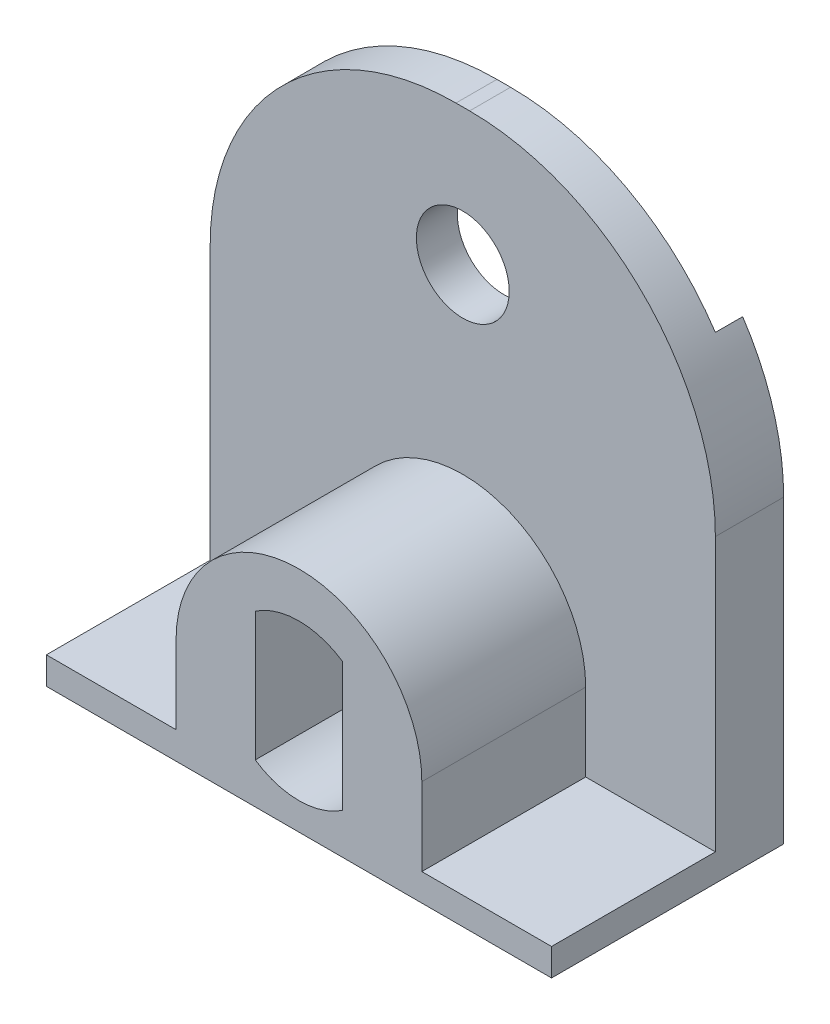
ISO-10303-21;
HEADER;
FILE_DESCRIPTION(('STEP AP214'),'2;1');
FILE_NAME('part.step','',(''),(''),'','','');
FILE_SCHEMA(('AUTOMOTIVE_DESIGN { 1 0 10303 214 1 1 1 1 }'));
ENDSEC;
DATA;
#1=APPLICATION_CONTEXT('core data for automotive mechanical design processes');
#2=APPLICATION_PROTOCOL_DEFINITION('international standard','automotive_design',2000,#1);
#3=PRODUCT_CONTEXT('',#1,'mechanical');
#4=PRODUCT('Part','Part','',(#3));
#5=PRODUCT_RELATED_PRODUCT_CATEGORY('part','',(#4));
#6=PRODUCT_DEFINITION_FORMATION('','',#4);
#7=PRODUCT_DEFINITION_CONTEXT('part definition',#1,'design');
#8=PRODUCT_DEFINITION('design','',#6,#7);
#9=PRODUCT_DEFINITION_SHAPE('','',#8);
#10=(LENGTH_UNIT() NAMED_UNIT(*) SI_UNIT(.MILLI.,.METRE.));
#11=(NAMED_UNIT(*) PLANE_ANGLE_UNIT() SI_UNIT($,.RADIAN.));
#12=(NAMED_UNIT(*) SI_UNIT($,.STERADIAN.) SOLID_ANGLE_UNIT());
#13=UNCERTAINTY_MEASURE_WITH_UNIT(LENGTH_MEASURE(1.E-05),#10,'distance_accuracy_value','');
#14=(GEOMETRIC_REPRESENTATION_CONTEXT(3) GLOBAL_UNCERTAINTY_ASSIGNED_CONTEXT((#13)) GLOBAL_UNIT_ASSIGNED_CONTEXT((#10,
#11,#12)) REPRESENTATION_CONTEXT('',''));
#15=CARTESIAN_POINT('',(0.,0.,0.));
#16=DIRECTION('',(0.,0.,1.));
#17=DIRECTION('',(1.,0.,0.));
#18=AXIS2_PLACEMENT_3D('',#15,#16,#17);
#19=CARTESIAN_POINT('',(-1.5,20.,1.5));
#20=DIRECTION('',(0.,0.,-1.));
#21=DIRECTION('',(-1.,0.,0.));
#22=AXIS2_PLACEMENT_3D('',#19,#20,#21);
#23=PLANE('',#22);
#24=CARTESIAN_POINT('',(7.75,15.,1.5));
#25=DIRECTION('',(0.,0.,1.));
#26=DIRECTION('',(1.,0.,0.));
#27=AXIS2_PLACEMENT_3D('',#24,#25,#26);
#28=CIRCLE('',#27,1.7);
#29=CARTESIAN_POINT('',(9.45,15.,1.5));
#30=VERTEX_POINT('',#29);
#31=EDGE_CURVE('E246',#30,#30,#28,.T.);
#32=ORIENTED_EDGE('',*,*,#31,.F.);
#33=EDGE_LOOP('',(#32));
#34=FACE_BOUND('',#33,.T.);
#35=DIRECTION('',(0.,-1.,0.));
#36=VECTOR('',#35,1.);
#37=CARTESIAN_POINT('',(3.25,1.02379637549047,1.5));
#38=LINE('',#37,#36);
#39=CARTESIAN_POINT('',(3.25,3.85,1.5));
#40=VERTEX_POINT('',#39);
#41=CARTESIAN_POINT('',(3.25,1.,1.5));
#42=VERTEX_POINT('',#41);
#43=EDGE_CURVE('E188',#40,#42,#38,.T.);
#44=ORIENTED_EDGE('',*,*,#43,.F.);
#45=CARTESIAN_POINT('',(7.75,3.85,1.5));
#46=DIRECTION('',(0.,0.,1.));
#47=DIRECTION('',(1.,0.,0.));
#48=AXIS2_PLACEMENT_3D('',#45,#46,#47);
#49=CIRCLE('',#48,4.5);
#50=CARTESIAN_POINT('',(12.25,3.85,1.5));
#51=VERTEX_POINT('',#50);
#52=EDGE_CURVE('E200',#51,#40,#49,.T.);
#53=ORIENTED_EDGE('',*,*,#52,.F.);
#54=DIRECTION('',(0.,1.,0.));
#55=VECTOR('',#54,1.);
#56=CARTESIAN_POINT('',(12.25,1.02379637549047,1.5));
#57=LINE('',#56,#55);
#58=CARTESIAN_POINT('',(12.25,1.,1.5));
#59=VERTEX_POINT('',#58);
#60=EDGE_CURVE('E187',#59,#51,#57,.T.);
#61=ORIENTED_EDGE('',*,*,#60,.F.);
#62=DIRECTION('',(-1.,0.,0.));
#63=VECTOR('',#62,1.);
#64=CARTESIAN_POINT('',(-1.5,1.,1.5));
#65=LINE('',#64,#63);
#66=CARTESIAN_POINT('',(17.,1.,1.5));
#67=VERTEX_POINT('',#66);
#68=EDGE_CURVE('E59',#67,#59,#65,.T.);
#69=ORIENTED_EDGE('',*,*,#68,.F.);
#70=DIRECTION('',(0.,-1.,0.));
#71=VECTOR('',#70,1.);
#72=CARTESIAN_POINT('',(17.,20.,1.5));
#73=LINE('',#72,#71);
#74=CARTESIAN_POINT('',(17.,11.,1.5));
#75=VERTEX_POINT('',#74);
#76=EDGE_CURVE('E283',#75,#67,#73,.T.);
#77=ORIENTED_EDGE('',*,*,#76,.F.);
#78=CARTESIAN_POINT('',(8.,11.,1.5));
#79=DIRECTION('',(0.,0.,-1.));
#80=DIRECTION('',(-1.,0.,0.));
#81=AXIS2_PLACEMENT_3D('',#78,#79,#80);
#82=CIRCLE('',#81,9.);
#83=CARTESIAN_POINT('',(8.,20.,1.5));
#84=VERTEX_POINT('',#83);
#85=EDGE_CURVE('E298',#75,#84,#82,.F.);
#86=ORIENTED_EDGE('',*,*,#85,.T.);
#87=DIRECTION('',(1.,0.,0.));
#88=VECTOR('',#87,1.);
#89=CARTESIAN_POINT('',(-1.5,20.,1.5));
#90=LINE('',#89,#88);
#91=CARTESIAN_POINT('',(7.5,20.,1.5));
#92=VERTEX_POINT('',#91);
#93=EDGE_CURVE('E249',#92,#84,#90,.T.);
#94=ORIENTED_EDGE('',*,*,#93,.F.);
#95=CARTESIAN_POINT('',(7.5,11.,1.5));
#96=DIRECTION('',(0.,0.,-1.));
#97=DIRECTION('',(-1.,0.,0.));
#98=AXIS2_PLACEMENT_3D('',#95,#96,#97);
#99=CIRCLE('',#98,9.);
#100=CARTESIAN_POINT('',(-1.5,11.,1.5));
#101=VERTEX_POINT('',#100);
#102=EDGE_CURVE('E300',#92,#101,#99,.F.);
#103=ORIENTED_EDGE('',*,*,#102,.T.);
#104=DIRECTION('',(0.,-1.,0.));
#105=VECTOR('',#104,1.);
#106=CARTESIAN_POINT('',(-1.5,20.,1.5));
#107=LINE('',#106,#105);
#108=CARTESIAN_POINT('',(-1.5,1.,1.5));
#109=VERTEX_POINT('',#108);
#110=EDGE_CURVE('E285',#101,#109,#107,.T.);
#111=ORIENTED_EDGE('',*,*,#110,.T.);
#112=EDGE_CURVE('E228',#42,#109,#65,.T.);
#113=ORIENTED_EDGE('',*,*,#112,.F.);
#114=EDGE_LOOP('',(#44,#53,#61,#69,#77,#86,#94,#103,#111,#113));
#115=FACE_BOUND('',#114,.T.);
#116=ADVANCED_FACE('F35',(#34,#115),#23,.F.);
#117=CARTESIAN_POINT('',(-1.5,1.,7.5));
#118=DIRECTION('',(0.,-1.,0.));
#119=DIRECTION('',(1.,0.,0.));
#120=AXIS2_PLACEMENT_3D('',#117,#118,#119);
#121=PLANE('',#120);
#122=DIRECTION('',(0.,0.,1.));
#123=VECTOR('',#122,1.);
#124=CARTESIAN_POINT('',(3.25,1.,7.5));
#125=LINE('',#124,#123);
#126=CARTESIAN_POINT('',(3.25,1.,7.5));
#127=VERTEX_POINT('',#126);
#128=EDGE_CURVE('E226',#42,#127,#125,.T.);
#129=ORIENTED_EDGE('',*,*,#128,.F.);
#130=ORIENTED_EDGE('',*,*,#112,.T.);
#131=DIRECTION('',(0.,0.,-1.));
#132=VECTOR('',#131,1.);
#133=CARTESIAN_POINT('',(-1.5,1.,7.5));
#134=LINE('',#133,#132);
#135=CARTESIAN_POINT('',(-1.5,1.,7.5));
#136=VERTEX_POINT('',#135);
#137=EDGE_CURVE('E239',#136,#109,#134,.T.);
#138=ORIENTED_EDGE('',*,*,#137,.F.);
#139=DIRECTION('',(-1.,0.,0.));
#140=VECTOR('',#139,1.);
#141=CARTESIAN_POINT('',(-1.5,1.,7.5));
#142=LINE('',#141,#140);
#143=EDGE_CURVE('E237',#127,#136,#142,.T.);
#144=ORIENTED_EDGE('',*,*,#143,.F.);
#145=EDGE_LOOP('',(#129,#130,#138,#144));
#146=FACE_BOUND('',#145,.T.);
#147=ADVANCED_FACE('F350',(#146),#121,.F.);
#148=DIRECTION('',(0.,0.,-1.));
#149=VECTOR('',#148,1.);
#150=CARTESIAN_POINT('',(12.25,1.,7.5));
#151=LINE('',#150,#149);
#152=CARTESIAN_POINT('',(12.25,1.,7.5));
#153=VERTEX_POINT('',#152);
#154=EDGE_CURVE('E222',#153,#59,#151,.T.);
#155=ORIENTED_EDGE('',*,*,#154,.F.);
#156=CARTESIAN_POINT('',(17.,1.,7.5));
#157=VERTEX_POINT('',#156);
#158=EDGE_CURVE('E183',#157,#153,#142,.T.);
#159=ORIENTED_EDGE('',*,*,#158,.F.);
#160=DIRECTION('',(0.,0.,-1.));
#161=VECTOR('',#160,1.);
#162=CARTESIAN_POINT('',(17.,1.,7.5));
#163=LINE('',#162,#161);
#164=EDGE_CURVE('E243',#157,#67,#163,.T.);
#165=ORIENTED_EDGE('',*,*,#164,.T.);
#166=ORIENTED_EDGE('',*,*,#68,.T.);
#167=EDGE_LOOP('',(#155,#159,#165,#166));
#168=FACE_BOUND('',#167,.T.);
#169=ADVANCED_FACE('F393',(#168),#121,.F.);
#170=CARTESIAN_POINT('',(0.,20.,0.));
#171=DIRECTION('',(-1.,0.,0.));
#172=DIRECTION('',(0.,0.,1.));
#173=AXIS2_PLACEMENT_3D('',#170,#171,#172);
#174=PLANE('',#173);
#175=DIRECTION('',(0.,-1.,0.));
#176=VECTOR('',#175,1.);
#177=CARTESIAN_POINT('',(0.,20.,-1.));
#178=LINE('',#177,#176);
#179=CARTESIAN_POINT('',(0.,15.9749371855331,-1.));
#180=VERTEX_POINT('',#179);
#181=CARTESIAN_POINT('',(0.,0.,-1.));
#182=VERTEX_POINT('',#181);
#183=EDGE_CURVE('E290',#180,#182,#178,.T.);
#184=ORIENTED_EDGE('',*,*,#183,.F.);
#185=DIRECTION('',(0.,0.,-1.));
#186=VECTOR('',#185,1.);
#187=CARTESIAN_POINT('',(0.,15.9749371855331,-1.));
#188=LINE('',#187,#186);
#189=CARTESIAN_POINT('',(0.,15.9749371855331,0.));
#190=VERTEX_POINT('',#189);
#191=EDGE_CURVE('E306',#180,#190,#188,.F.);
#192=ORIENTED_EDGE('',*,*,#191,.T.);
#193=DIRECTION('',(0.,-1.,0.));
#194=VECTOR('',#193,1.);
#195=CARTESIAN_POINT('',(0.,20.,0.));
#196=LINE('',#195,#194);
#197=CARTESIAN_POINT('',(0.,0.,0.));
#198=VERTEX_POINT('',#197);
#199=EDGE_CURVE('E256',#190,#198,#196,.T.);
#200=ORIENTED_EDGE('',*,*,#199,.T.);
#201=DIRECTION('',(0.,0.,-1.));
#202=VECTOR('',#201,1.);
#203=CARTESIAN_POINT('',(0.,0.,0.));
#204=LINE('',#203,#202);
#205=EDGE_CURVE('E257',#198,#182,#204,.T.);
#206=ORIENTED_EDGE('',*,*,#205,.T.);
#207=EDGE_LOOP('',(#184,#192,#200,#206));
#208=FACE_BOUND('',#207,.T.);
#209=ADVANCED_FACE('F414',(#208),#174,.F.);
#210=CARTESIAN_POINT('',(0.,20.,-1.));
#211=DIRECTION('',(0.,0.,1.));
#212=DIRECTION('',(1.,0.,0.));
#213=AXIS2_PLACEMENT_3D('',#210,#211,#212);
#214=PLANE('',#213);
#215=DIRECTION('',(0.,-1.,0.));
#216=VECTOR('',#215,1.);
#217=CARTESIAN_POINT('',(-1.5,20.,-1.));
#218=LINE('',#217,#216);
#219=CARTESIAN_POINT('',(-1.5,11.,-1.));
#220=VERTEX_POINT('',#219);
#221=CARTESIAN_POINT('',(-1.5,0.,-1.));
#222=VERTEX_POINT('',#221);
#223=EDGE_CURVE('E288',#220,#222,#218,.T.);
#224=ORIENTED_EDGE('',*,*,#223,.F.);
#225=CARTESIAN_POINT('',(7.5,11.,-1.));
#226=DIRECTION('',(0.,0.,1.));
#227=DIRECTION('',(1.,0.,0.));
#228=AXIS2_PLACEMENT_3D('',#225,#226,#227);
#229=CIRCLE('',#228,9.);
#230=EDGE_CURVE('E304',#220,#180,#229,.F.);
#231=ORIENTED_EDGE('',*,*,#230,.T.);
#232=ORIENTED_EDGE('',*,*,#183,.T.);
#233=DIRECTION('',(-1.,0.,0.));
#234=VECTOR('',#233,1.);
#235=CARTESIAN_POINT('',(0.,0.,-1.));
#236=LINE('',#235,#234);
#237=EDGE_CURVE('E260',#182,#222,#236,.T.);
#238=ORIENTED_EDGE('',*,*,#237,.T.);
#239=EDGE_LOOP('',(#224,#231,#232,#238));
#240=FACE_BOUND('',#239,.T.);
#241=ADVANCED_FACE('F416',(#240),#214,.F.);
#242=CARTESIAN_POINT('',(-1.5,20.,-1.));
#243=DIRECTION('',(1.,0.,0.));
#244=DIRECTION('',(0.,0.,-1.));
#245=AXIS2_PLACEMENT_3D('',#242,#243,#244);
#246=PLANE('',#245);
#247=ORIENTED_EDGE('',*,*,#110,.F.);
#248=DIRECTION('',(0.,0.,1.));
#249=VECTOR('',#248,1.);
#250=CARTESIAN_POINT('',(-1.5,11.,-1.));
#251=LINE('',#250,#249);
#252=EDGE_CURVE('E302',#101,#220,#251,.F.);
#253=ORIENTED_EDGE('',*,*,#252,.T.);
#254=ORIENTED_EDGE('',*,*,#223,.T.);
#255=DIRECTION('',(0.,0.,1.));
#256=VECTOR('',#255,1.);
#257=CARTESIAN_POINT('',(-1.5,0.,-1.));
#258=LINE('',#257,#256);
#259=CARTESIAN_POINT('',(-1.5,0.,7.5));
#260=VERTEX_POINT('',#259);
#261=EDGE_CURVE('E263',#222,#260,#258,.T.);
#262=ORIENTED_EDGE('',*,*,#261,.T.);
#263=DIRECTION('',(0.,-1.,0.));
#264=VECTOR('',#263,1.);
#265=CARTESIAN_POINT('',(-1.5,0.,7.5));
#266=LINE('',#265,#264);
#267=EDGE_CURVE('E229',#136,#260,#266,.T.);
#268=ORIENTED_EDGE('',*,*,#267,.F.);
#269=ORIENTED_EDGE('',*,*,#137,.T.);
#270=EDGE_LOOP('',(#247,#253,#254,#262,#268,#269));
#271=FACE_BOUND('',#270,.T.);
#272=ADVANCED_FACE('F343',(#271),#246,.F.);
#273=CARTESIAN_POINT('',(17.,20.,1.5));
#274=DIRECTION('',(-1.,0.,0.));
#275=DIRECTION('',(0.,0.,1.));
#276=AXIS2_PLACEMENT_3D('',#273,#274,#275);
#277=PLANE('',#276);
#278=DIRECTION('',(0.,-1.,0.));
#279=VECTOR('',#278,1.);
#280=CARTESIAN_POINT('',(17.,20.,-1.));
#281=LINE('',#280,#279);
#282=CARTESIAN_POINT('',(17.,11.,-1.));
#283=VERTEX_POINT('',#282);
#284=CARTESIAN_POINT('',(17.,0.,-1.));
#285=VERTEX_POINT('',#284);
#286=EDGE_CURVE('E281',#283,#285,#281,.T.);
#287=ORIENTED_EDGE('',*,*,#286,.F.);
#288=DIRECTION('',(0.,0.,-1.));
#289=VECTOR('',#288,1.);
#290=CARTESIAN_POINT('',(17.,11.,1.5));
#291=LINE('',#290,#289);
#292=EDGE_CURVE('E11',#283,#75,#291,.F.);
#293=ORIENTED_EDGE('',*,*,#292,.T.);
#294=ORIENTED_EDGE('',*,*,#76,.T.);
#295=ORIENTED_EDGE('',*,*,#164,.F.);
#296=DIRECTION('',(0.,1.,0.));
#297=VECTOR('',#296,1.);
#298=CARTESIAN_POINT('',(17.,0.,7.5));
#299=LINE('',#298,#297);
#300=CARTESIAN_POINT('',(17.,0.,7.5));
#301=VERTEX_POINT('',#300);
#302=EDGE_CURVE('E235',#301,#157,#299,.T.);
#303=ORIENTED_EDGE('',*,*,#302,.F.);
#304=DIRECTION('',(0.,0.,-1.));
#305=VECTOR('',#304,1.);
#306=CARTESIAN_POINT('',(17.,0.,1.5));
#307=LINE('',#306,#305);
#308=EDGE_CURVE('E265',#301,#285,#307,.T.);
#309=ORIENTED_EDGE('',*,*,#308,.T.);
#310=EDGE_LOOP('',(#287,#293,#294,#295,#303,#309));
#311=FACE_BOUND('',#310,.T.);
#312=ADVANCED_FACE('F323',(#311),#277,.F.);
#313=CARTESIAN_POINT('',(17.,20.,-1.));
#314=DIRECTION('',(0.,0.,1.));
#315=DIRECTION('',(1.,0.,0.));
#316=AXIS2_PLACEMENT_3D('',#313,#314,#315);
#317=PLANE('',#316);
#318=DIRECTION('',(0.,-1.,0.));
#319=VECTOR('',#318,1.);
#320=CARTESIAN_POINT('',(15.5,20.,-1.));
#321=LINE('',#320,#319);
#322=CARTESIAN_POINT('',(15.5,15.9749371855331,-1.));
#323=VERTEX_POINT('',#322);
#324=CARTESIAN_POINT('',(15.5,0.,-1.));
#325=VERTEX_POINT('',#324);
#326=EDGE_CURVE('E279',#323,#325,#321,.T.);
#327=ORIENTED_EDGE('',*,*,#326,.F.);
#328=CARTESIAN_POINT('',(8.,11.,-0.999999999999998));
#329=DIRECTION('',(0.,0.,1.));
#330=DIRECTION('',(1.,0.,0.));
#331=AXIS2_PLACEMENT_3D('',#328,#329,#330);
#332=CIRCLE('',#331,9.);
#333=EDGE_CURVE('E44',#323,#283,#332,.F.);
#334=ORIENTED_EDGE('',*,*,#333,.T.);
#335=ORIENTED_EDGE('',*,*,#286,.T.);
#336=DIRECTION('',(-1.,0.,0.));
#337=VECTOR('',#336,1.);
#338=CARTESIAN_POINT('',(17.,0.,-1.));
#339=LINE('',#338,#337);
#340=EDGE_CURVE('E268',#285,#325,#339,.T.);
#341=ORIENTED_EDGE('',*,*,#340,.T.);
#342=EDGE_LOOP('',(#327,#334,#335,#341));
#343=FACE_BOUND('',#342,.T.);
#344=ADVANCED_FACE('F318',(#343),#317,.F.);
#345=CARTESIAN_POINT('',(15.5,20.,-1.));
#346=DIRECTION('',(1.,0.,0.));
#347=DIRECTION('',(0.,0.,-1.));
#348=AXIS2_PLACEMENT_3D('',#345,#346,#347);
#349=PLANE('',#348);
#350=DIRECTION('',(0.,-1.,0.));
#351=VECTOR('',#350,1.);
#352=CARTESIAN_POINT('',(15.5,20.,0.));
#353=LINE('',#352,#351);
#354=CARTESIAN_POINT('',(15.5,15.9749371855331,0.));
#355=VERTEX_POINT('',#354);
#356=CARTESIAN_POINT('',(15.5,0.,0.));
#357=VERTEX_POINT('',#356);
#358=EDGE_CURVE('E277',#355,#357,#353,.T.);
#359=ORIENTED_EDGE('',*,*,#358,.F.);
#360=DIRECTION('',(0.,0.,1.));
#361=VECTOR('',#360,1.);
#362=CARTESIAN_POINT('',(15.5,15.9749371855331,0.));
#363=LINE('',#362,#361);
#364=EDGE_CURVE('E312',#355,#323,#363,.F.);
#365=ORIENTED_EDGE('',*,*,#364,.T.);
#366=ORIENTED_EDGE('',*,*,#326,.T.);
#367=DIRECTION('',(0.,0.,1.));
#368=VECTOR('',#367,1.);
#369=CARTESIAN_POINT('',(15.5,0.,-1.));
#370=LINE('',#369,#368);
#371=EDGE_CURVE('E271',#325,#357,#370,.T.);
#372=ORIENTED_EDGE('',*,*,#371,.T.);
#373=EDGE_LOOP('',(#359,#365,#366,#372));
#374=FACE_BOUND('',#373,.T.);
#375=ADVANCED_FACE('F407',(#374),#349,.F.);
#376=CARTESIAN_POINT('',(0.,20.,0.));
#377=DIRECTION('',(0.,0.,1.));
#378=DIRECTION('',(1.,0.,0.));
#379=AXIS2_PLACEMENT_3D('',#376,#377,#378);
#380=PLANE('',#379);
#381=CARTESIAN_POINT('',(7.75,15.,0.));
#382=DIRECTION('',(0.,0.,1.));
#383=DIRECTION('',(1.,0.,0.));
#384=AXIS2_PLACEMENT_3D('',#381,#382,#383);
#385=CIRCLE('',#384,1.7);
#386=CARTESIAN_POINT('',(9.45,15.,0.));
#387=VERTEX_POINT('',#386);
#388=EDGE_CURVE('E39',#387,#387,#385,.T.);
#389=ORIENTED_EDGE('',*,*,#388,.T.);
#390=EDGE_LOOP('',(#389));
#391=FACE_BOUND('',#390,.T.);
#392=ORIENTED_EDGE('',*,*,#199,.F.);
#393=CARTESIAN_POINT('',(7.5,11.,0.));
#394=DIRECTION('',(0.,0.,1.));
#395=DIRECTION('',(1.,0.,0.));
#396=AXIS2_PLACEMENT_3D('',#393,#394,#395);
#397=CIRCLE('',#396,9.);
#398=CARTESIAN_POINT('',(7.5,20.,0.));
#399=VERTEX_POINT('',#398);
#400=EDGE_CURVE('E310',#190,#399,#397,.F.);
#401=ORIENTED_EDGE('',*,*,#400,.T.);
#402=DIRECTION('',(-1.,0.,0.));
#403=VECTOR('',#402,1.);
#404=CARTESIAN_POINT('',(0.,20.,0.));
#405=LINE('',#404,#403);
#406=CARTESIAN_POINT('',(8.,20.,0.));
#407=VERTEX_POINT('',#406);
#408=EDGE_CURVE('E252',#407,#399,#405,.T.);
#409=ORIENTED_EDGE('',*,*,#408,.F.);
#410=CARTESIAN_POINT('',(8.,11.,0.));
#411=DIRECTION('',(0.,0.,1.));
#412=DIRECTION('',(1.,0.,0.));
#413=AXIS2_PLACEMENT_3D('',#410,#411,#412);
#414=CIRCLE('',#413,9.);
#415=EDGE_CURVE('E308',#407,#355,#414,.F.);
#416=ORIENTED_EDGE('',*,*,#415,.T.);
#417=ORIENTED_EDGE('',*,*,#358,.T.);
#418=DIRECTION('',(-1.,0.,0.));
#419=VECTOR('',#418,1.);
#420=CARTESIAN_POINT('',(0.,0.,0.));
#421=LINE('',#420,#419);
#422=EDGE_CURVE('E253',#357,#198,#421,.T.);
#423=ORIENTED_EDGE('',*,*,#422,.T.);
#424=EDGE_LOOP('',(#392,#401,#409,#416,#417,#423));
#425=FACE_BOUND('',#424,.T.);
#426=ADVANCED_FACE('F404',(#391,#425),#380,.F.);
#427=CARTESIAN_POINT('',(0.,20.,0.));
#428=DIRECTION('',(0.,1.,0.));
#429=DIRECTION('',(0.,0.,1.));
#430=AXIS2_PLACEMENT_3D('',#427,#428,#429);
#431=PLANE('',#430);
#432=ORIENTED_EDGE('',*,*,#408,.T.);
#433=DIRECTION('',(0.,0.,1.));
#434=VECTOR('',#433,1.);
#435=CARTESIAN_POINT('',(7.5,20.,1.5));
#436=LINE('',#435,#434);
#437=EDGE_CURVE('E295',#399,#92,#436,.T.);
#438=ORIENTED_EDGE('',*,*,#437,.T.);
#439=ORIENTED_EDGE('',*,*,#93,.T.);
#440=DIRECTION('',(0.,0.,-1.));
#441=VECTOR('',#440,1.);
#442=CARTESIAN_POINT('',(8.,20.,-1.));
#443=LINE('',#442,#441);
#444=EDGE_CURVE('E292',#84,#407,#443,.T.);
#445=ORIENTED_EDGE('',*,*,#444,.T.);
#446=EDGE_LOOP('',(#432,#438,#439,#445));
#447=FACE_BOUND('',#446,.T.);
#448=ADVANCED_FACE('F331',(#447),#431,.T.);
#449=CARTESIAN_POINT('',(0.,0.,0.));
#450=DIRECTION('',(0.,1.,0.));
#451=DIRECTION('',(0.,0.,1.));
#452=AXIS2_PLACEMENT_3D('',#449,#450,#451);
#453=PLANE('',#452);
#454=ORIENTED_EDGE('',*,*,#205,.F.);
#455=ORIENTED_EDGE('',*,*,#422,.F.);
#456=ORIENTED_EDGE('',*,*,#371,.F.);
#457=ORIENTED_EDGE('',*,*,#340,.F.);
#458=ORIENTED_EDGE('',*,*,#308,.F.);
#459=DIRECTION('',(1.,0.,0.));
#460=VECTOR('',#459,1.);
#461=CARTESIAN_POINT('',(-1.5,0.,7.5));
#462=LINE('',#461,#460);
#463=EDGE_CURVE('E232',#260,#301,#462,.T.);
#464=ORIENTED_EDGE('',*,*,#463,.F.);
#465=ORIENTED_EDGE('',*,*,#261,.F.);
#466=ORIENTED_EDGE('',*,*,#237,.F.);
#467=EDGE_LOOP('',(#454,#455,#456,#457,#458,#464,#465,#466));
#468=FACE_BOUND('',#467,.T.);
#469=ADVANCED_FACE('F421',(#468),#453,.F.);
#470=CARTESIAN_POINT('',(7.5,11.,0.));
#471=DIRECTION('',(0.,0.,-1.));
#472=DIRECTION('',(-1.,0.,0.));
#473=AXIS2_PLACEMENT_3D('',#470,#471,#472);
#474=CYLINDRICAL_SURFACE('',#473,9.);
#475=ORIENTED_EDGE('',*,*,#230,.F.);
#476=ORIENTED_EDGE('',*,*,#252,.F.);
#477=ORIENTED_EDGE('',*,*,#102,.F.);
#478=ORIENTED_EDGE('',*,*,#437,.F.);
#479=ORIENTED_EDGE('',*,*,#400,.F.);
#480=ORIENTED_EDGE('',*,*,#191,.F.);
#481=EDGE_LOOP('',(#475,#476,#477,#478,#479,#480));
#482=FACE_BOUND('',#481,.T.);
#483=ADVANCED_FACE('F337',(#482),#474,.T.);
#484=CARTESIAN_POINT('',(8.,11.,0.));
#485=DIRECTION('',(0.,0.,1.));
#486=DIRECTION('',(1.,0.,0.));
#487=AXIS2_PLACEMENT_3D('',#484,#485,#486);
#488=CYLINDRICAL_SURFACE('',#487,9.);
#489=ORIENTED_EDGE('',*,*,#85,.F.);
#490=ORIENTED_EDGE('',*,*,#292,.F.);
#491=ORIENTED_EDGE('',*,*,#333,.F.);
#492=ORIENTED_EDGE('',*,*,#364,.F.);
#493=ORIENTED_EDGE('',*,*,#415,.F.);
#494=ORIENTED_EDGE('',*,*,#444,.F.);
#495=EDGE_LOOP('',(#489,#490,#491,#492,#493,#494));
#496=FACE_BOUND('',#495,.T.);
#497=ADVANCED_FACE('F37',(#496),#488,.T.);
#498=CARTESIAN_POINT('',(7.75,15.,-1.));
#499=DIRECTION('',(0.,0.,1.));
#500=DIRECTION('',(1.,0.,0.));
#501=AXIS2_PLACEMENT_3D('',#498,#499,#500);
#502=CYLINDRICAL_SURFACE('',#501,1.7);
#503=ORIENTED_EDGE('',*,*,#31,.T.);
#504=EDGE_LOOP('',(#503));
#505=FACE_BOUND('',#504,.T.);
#506=ORIENTED_EDGE('',*,*,#388,.F.);
#507=EDGE_LOOP('',(#506));
#508=FACE_BOUND('',#507,.T.);
#509=ADVANCED_FACE('F397',(#505,#508),#502,.F.);
#510=CARTESIAN_POINT('',(0.,0.,7.5));
#511=DIRECTION('',(0.,0.,-1.));
#512=DIRECTION('',(-1.,0.,0.));
#513=AXIS2_PLACEMENT_3D('',#510,#511,#512);
#514=PLANE('',#513);
#515=DIRECTION('',(0.,1.,0.));
#516=VECTOR('',#515,1.);
#517=CARTESIAN_POINT('',(3.25,1.02379637549047,7.5));
#518=LINE('',#517,#516);
#519=CARTESIAN_POINT('',(3.25,3.85,7.5));
#520=VERTEX_POINT('',#519);
#521=EDGE_CURVE('E202',#127,#520,#518,.T.);
#522=ORIENTED_EDGE('',*,*,#521,.F.);
#523=ORIENTED_EDGE('',*,*,#143,.T.);
#524=ORIENTED_EDGE('',*,*,#267,.T.);
#525=ORIENTED_EDGE('',*,*,#463,.T.);
#526=ORIENTED_EDGE('',*,*,#302,.T.);
#527=ORIENTED_EDGE('',*,*,#158,.T.);
#528=DIRECTION('',(0.,-1.,0.));
#529=VECTOR('',#528,1.);
#530=CARTESIAN_POINT('',(12.25,1.02379637549047,7.5));
#531=LINE('',#530,#529);
#532=CARTESIAN_POINT('',(12.25,3.85,7.5));
#533=VERTEX_POINT('',#532);
#534=EDGE_CURVE('E175',#533,#153,#531,.T.);
#535=ORIENTED_EDGE('',*,*,#534,.F.);
#536=CARTESIAN_POINT('',(7.75,3.85,7.5));
#537=DIRECTION('',(0.,0.,-1.));
#538=DIRECTION('',(-1.,0.,0.));
#539=AXIS2_PLACEMENT_3D('',#536,#537,#538);
#540=CIRCLE('',#539,4.5);
#541=EDGE_CURVE('E180',#520,#533,#540,.T.);
#542=ORIENTED_EDGE('',*,*,#541,.F.);
#543=EDGE_LOOP('',(#522,#523,#524,#525,#526,#527,#535,#542));
#544=FACE_BOUND('',#543,.T.);
#545=DIRECTION('',(0.,-1.,0.));
#546=VECTOR('',#545,1.);
#547=CARTESIAN_POINT('',(9.35,6.20849528301415,7.5));
#548=LINE('',#547,#546);
#549=CARTESIAN_POINT('',(9.35,6.20849528301415,7.5));
#550=VERTEX_POINT('',#549);
#551=CARTESIAN_POINT('',(9.35,1.49150471698585,7.5));
#552=VERTEX_POINT('',#551);
#553=EDGE_CURVE('E219',#550,#552,#548,.T.);
#554=ORIENTED_EDGE('',*,*,#553,.T.);
#555=CARTESIAN_POINT('',(7.75,3.85,7.5));
#556=DIRECTION('',(0.,0.,-1.));
#557=DIRECTION('',(-1.,0.,0.));
#558=AXIS2_PLACEMENT_3D('',#555,#556,#557);
#559=CIRCLE('',#558,2.85);
#560=CARTESIAN_POINT('',(6.15,1.49150471698585,7.5));
#561=VERTEX_POINT('',#560);
#562=EDGE_CURVE('E223',#552,#561,#559,.T.);
#563=ORIENTED_EDGE('',*,*,#562,.T.);
#564=DIRECTION('',(0.,1.,0.));
#565=VECTOR('',#564,1.);
#566=CARTESIAN_POINT('',(6.15,6.20849528301415,7.5));
#567=LINE('',#566,#565);
#568=CARTESIAN_POINT('',(6.15,6.20849528301415,7.5));
#569=VERTEX_POINT('',#568);
#570=EDGE_CURVE('E220',#561,#569,#567,.T.);
#571=ORIENTED_EDGE('',*,*,#570,.T.);
#572=CARTESIAN_POINT('',(7.75,3.85,7.5));
#573=DIRECTION('',(0.,0.,-1.));
#574=DIRECTION('',(-1.,0.,0.));
#575=AXIS2_PLACEMENT_3D('',#572,#573,#574);
#576=CIRCLE('',#575,2.85);
#577=EDGE_CURVE('E215',#569,#550,#576,.T.);
#578=ORIENTED_EDGE('',*,*,#577,.T.);
#579=EDGE_LOOP('',(#554,#563,#571,#578));
#580=FACE_BOUND('',#579,.T.);
#581=ADVANCED_FACE('F178',(#544,#580),#514,.F.);
#582=CARTESIAN_POINT('',(3.25,1.02379637549047,19.2633027537079));
#583=DIRECTION('',(1.,0.,0.));
#584=DIRECTION('',(0.,0.,-1.));
#585=AXIS2_PLACEMENT_3D('',#582,#583,#584);
#586=PLANE('',#585);
#587=ORIENTED_EDGE('',*,*,#43,.T.);
#588=ORIENTED_EDGE('',*,*,#128,.T.);
#589=ORIENTED_EDGE('',*,*,#521,.T.);
#590=DIRECTION('',(0.,0.,-1.));
#591=VECTOR('',#590,1.);
#592=CARTESIAN_POINT('',(3.25,3.85,19.2633027537079));
#593=LINE('',#592,#591);
#594=EDGE_CURVE('E196',#520,#40,#593,.T.);
#595=ORIENTED_EDGE('',*,*,#594,.T.);
#596=EDGE_LOOP('',(#587,#588,#589,#595));
#597=FACE_BOUND('',#596,.T.);
#598=ADVANCED_FACE('F422',(#597),#586,.F.);
#599=CARTESIAN_POINT('',(12.25,1.02379637549047,19.2633027537079));
#600=DIRECTION('',(-1.,0.,0.));
#601=DIRECTION('',(0.,-1.,0.));
#602=AXIS2_PLACEMENT_3D('',#599,#600,#601);
#603=PLANE('',#602);
#604=ORIENTED_EDGE('',*,*,#534,.T.);
#605=ORIENTED_EDGE('',*,*,#154,.T.);
#606=ORIENTED_EDGE('',*,*,#60,.T.);
#607=DIRECTION('',(0.,0.,-1.));
#608=VECTOR('',#607,1.);
#609=CARTESIAN_POINT('',(12.25,3.85,19.2633027537079));
#610=LINE('',#609,#608);
#611=EDGE_CURVE('E194',#533,#51,#610,.T.);
#612=ORIENTED_EDGE('',*,*,#611,.F.);
#613=EDGE_LOOP('',(#604,#605,#606,#612));
#614=FACE_BOUND('',#613,.T.);
#615=ADVANCED_FACE('F199',(#614),#603,.F.);
#616=CARTESIAN_POINT('',(7.75,3.85,19.2633027537079));
#617=DIRECTION('',(0.,0.,-1.));
#618=DIRECTION('',(-1.,0.,0.));
#619=AXIS2_PLACEMENT_3D('',#616,#617,#618);
#620=CYLINDRICAL_SURFACE('',#619,2.85);
#621=ORIENTED_EDGE('',*,*,#562,.F.);
#622=DIRECTION('',(0.,0.,-1.));
#623=VECTOR('',#622,1.);
#624=CARTESIAN_POINT('',(9.35,1.49150471698585,19.2633027537079));
#625=LINE('',#624,#623);
#626=CARTESIAN_POINT('',(9.35,1.49150471698585,1.5));
#627=VERTEX_POINT('',#626);
#628=EDGE_CURVE('E212',#552,#627,#625,.T.);
#629=ORIENTED_EDGE('',*,*,#628,.T.);
#630=CARTESIAN_POINT('',(7.75,3.85,1.5));
#631=DIRECTION('',(0.,0.,1.));
#632=DIRECTION('',(1.,0.,0.));
#633=AXIS2_PLACEMENT_3D('',#630,#631,#632);
#634=CIRCLE('',#633,2.85);
#635=CARTESIAN_POINT('',(6.15,1.49150471698585,1.5));
#636=VERTEX_POINT('',#635);
#637=EDGE_CURVE('E357',#636,#627,#634,.T.);
#638=ORIENTED_EDGE('',*,*,#637,.F.);
#639=DIRECTION('',(0.,0.,-1.));
#640=VECTOR('',#639,1.);
#641=CARTESIAN_POINT('',(6.15,1.49150471698585,19.2633027537079));
#642=LINE('',#641,#640);
#643=EDGE_CURVE('E209',#561,#636,#642,.T.);
#644=ORIENTED_EDGE('',*,*,#643,.F.);
#645=EDGE_LOOP('',(#621,#629,#638,#644));
#646=FACE_BOUND('',#645,.T.);
#647=ADVANCED_FACE('F372',(#646),#620,.F.);
#648=CARTESIAN_POINT('',(7.75,3.85,19.2633027537079));
#649=DIRECTION('',(0.,0.,-1.));
#650=DIRECTION('',(-1.,0.,0.));
#651=AXIS2_PLACEMENT_3D('',#648,#649,#650);
#652=CYLINDRICAL_SURFACE('',#651,4.5);
#653=ORIENTED_EDGE('',*,*,#594,.F.);
#654=ORIENTED_EDGE('',*,*,#541,.T.);
#655=ORIENTED_EDGE('',*,*,#611,.T.);
#656=ORIENTED_EDGE('',*,*,#52,.T.);
#657=EDGE_LOOP('',(#653,#654,#655,#656));
#658=FACE_BOUND('',#657,.T.);
#659=ADVANCED_FACE('F192',(#658),#652,.T.);
#660=CARTESIAN_POINT('',(7.75,3.85,19.2633027537079));
#661=DIRECTION('',(0.,0.,-1.));
#662=DIRECTION('',(-1.,0.,0.));
#663=AXIS2_PLACEMENT_3D('',#660,#661,#662);
#664=CYLINDRICAL_SURFACE('',#663,2.85);
#665=ORIENTED_EDGE('',*,*,#577,.F.);
#666=DIRECTION('',(0.,0.,-1.));
#667=VECTOR('',#666,1.);
#668=CARTESIAN_POINT('',(6.15,6.20849528301415,19.2633027537079));
#669=LINE('',#668,#667);
#670=CARTESIAN_POINT('',(6.15,6.20849528301415,1.5));
#671=VERTEX_POINT('',#670);
#672=EDGE_CURVE('E207',#569,#671,#669,.T.);
#673=ORIENTED_EDGE('',*,*,#672,.T.);
#674=CARTESIAN_POINT('',(7.75,3.85,1.5));
#675=DIRECTION('',(0.,0.,1.));
#676=DIRECTION('',(1.,0.,0.));
#677=AXIS2_PLACEMENT_3D('',#674,#675,#676);
#678=CIRCLE('',#677,2.85);
#679=CARTESIAN_POINT('',(9.35,6.20849528301415,1.5));
#680=VERTEX_POINT('',#679);
#681=EDGE_CURVE('E51',#680,#671,#678,.T.);
#682=ORIENTED_EDGE('',*,*,#681,.F.);
#683=DIRECTION('',(0.,0.,-1.));
#684=VECTOR('',#683,1.);
#685=CARTESIAN_POINT('',(9.35,6.20849528301415,19.2633027537079));
#686=LINE('',#685,#684);
#687=EDGE_CURVE('E214',#550,#680,#686,.T.);
#688=ORIENTED_EDGE('',*,*,#687,.F.);
#689=EDGE_LOOP('',(#665,#673,#682,#688));
#690=FACE_BOUND('',#689,.T.);
#691=ADVANCED_FACE('F433',(#690),#664,.F.);
#692=CARTESIAN_POINT('',(6.15,6.20849528301415,19.2633027537079));
#693=DIRECTION('',(1.,0.,0.));
#694=DIRECTION('',(0.,0.,-1.));
#695=AXIS2_PLACEMENT_3D('',#692,#693,#694);
#696=PLANE('',#695);
#697=ORIENTED_EDGE('',*,*,#570,.F.);
#698=ORIENTED_EDGE('',*,*,#643,.T.);
#699=DIRECTION('',(0.,-1.,0.));
#700=VECTOR('',#699,1.);
#701=CARTESIAN_POINT('',(6.15,6.20849528301415,1.5));
#702=LINE('',#701,#700);
#703=EDGE_CURVE('E360',#671,#636,#702,.T.);
#704=ORIENTED_EDGE('',*,*,#703,.F.);
#705=ORIENTED_EDGE('',*,*,#672,.F.);
#706=EDGE_LOOP('',(#697,#698,#704,#705));
#707=FACE_BOUND('',#706,.T.);
#708=ADVANCED_FACE('F376',(#707),#696,.T.);
#709=CARTESIAN_POINT('',(9.35,6.20849528301415,19.2633027537079));
#710=DIRECTION('',(-1.,0.,0.));
#711=DIRECTION('',(0.,0.,1.));
#712=AXIS2_PLACEMENT_3D('',#709,#710,#711);
#713=PLANE('',#712);
#714=ORIENTED_EDGE('',*,*,#553,.F.);
#715=ORIENTED_EDGE('',*,*,#687,.T.);
#716=DIRECTION('',(0.,1.,0.));
#717=VECTOR('',#716,1.);
#718=CARTESIAN_POINT('',(9.35,6.20849528301415,1.5));
#719=LINE('',#718,#717);
#720=EDGE_CURVE('E197',#627,#680,#719,.T.);
#721=ORIENTED_EDGE('',*,*,#720,.F.);
#722=ORIENTED_EDGE('',*,*,#628,.F.);
#723=EDGE_LOOP('',(#714,#715,#721,#722));
#724=FACE_BOUND('',#723,.T.);
#725=ADVANCED_FACE('F370',(#724),#713,.T.);
#726=ORIENTED_EDGE('',*,*,#720,.T.);
#727=ORIENTED_EDGE('',*,*,#681,.T.);
#728=ORIENTED_EDGE('',*,*,#703,.T.);
#729=ORIENTED_EDGE('',*,*,#637,.T.);
#730=EDGE_LOOP('',(#726,#727,#728,#729));
#731=FACE_BOUND('',#730,.T.);
#732=ADVANCED_FACE('F379',(#731),#23,.F.);
#733=CLOSED_SHELL('',(#116,#147,#169,#209,#241,#272,#312,#344,#375,#426,#448,#469,#483,#497,
#509,#581,#598,#615,#647,#659,#691,#708,#725,#732));
#734=MANIFOLD_SOLID_BREP('B2',#733);
#735=ADVANCED_BREP_SHAPE_REPRESENTATION('',(#18,#734),#14);
#736=SHAPE_DEFINITION_REPRESENTATION(#9,#735);
ENDSEC;
END-ISO-10303-21;
